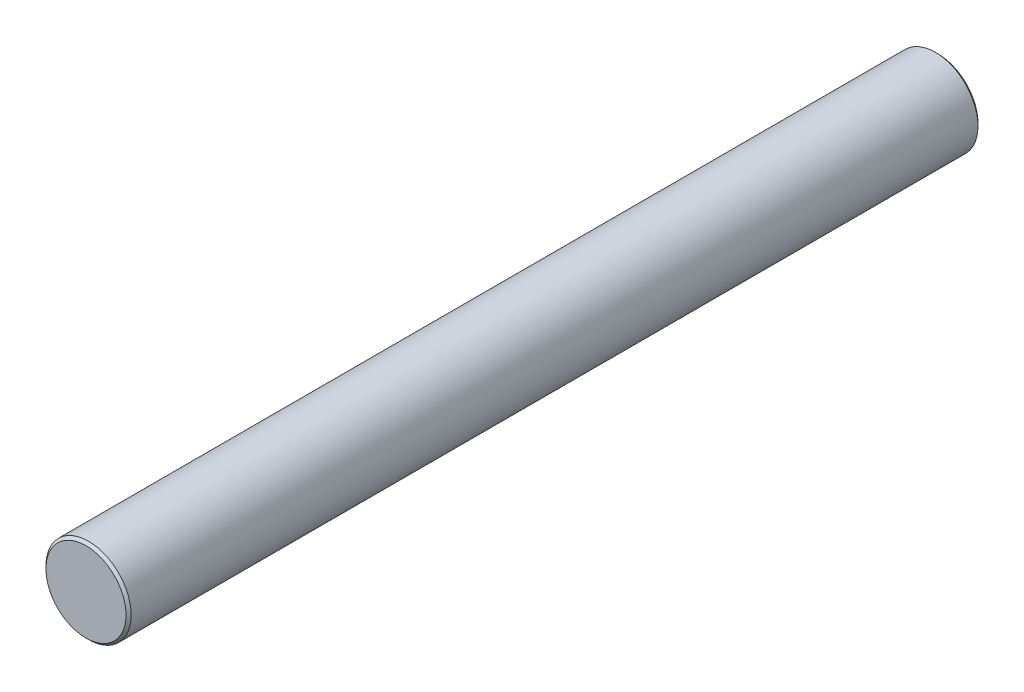
ISO-10303-21;
HEADER;
FILE_DESCRIPTION(('STEP AP214'),'2;1');
FILE_NAME('part.step','',(''),(''),'','','');
FILE_SCHEMA(('AUTOMOTIVE_DESIGN { 1 0 10303 214 1 1 1 1 }'));
ENDSEC;
DATA;
#1=APPLICATION_CONTEXT('core data for automotive mechanical design processes');
#2=APPLICATION_PROTOCOL_DEFINITION('international standard','automotive_design',2000,#1);
#3=PRODUCT_CONTEXT('',#1,'mechanical');
#4=PRODUCT('Part','Part','',(#3));
#5=PRODUCT_RELATED_PRODUCT_CATEGORY('part','',(#4));
#6=PRODUCT_DEFINITION_FORMATION('','',#4);
#7=PRODUCT_DEFINITION_CONTEXT('part definition',#1,'design');
#8=PRODUCT_DEFINITION('design','',#6,#7);
#9=PRODUCT_DEFINITION_SHAPE('','',#8);
#10=(LENGTH_UNIT() NAMED_UNIT(*) SI_UNIT(.MILLI.,.METRE.));
#11=(NAMED_UNIT(*) PLANE_ANGLE_UNIT() SI_UNIT($,.RADIAN.));
#12=(NAMED_UNIT(*) SI_UNIT($,.STERADIAN.) SOLID_ANGLE_UNIT());
#13=UNCERTAINTY_MEASURE_WITH_UNIT(LENGTH_MEASURE(1.E-05),#10,'distance_accuracy_value','');
#14=(GEOMETRIC_REPRESENTATION_CONTEXT(3) GLOBAL_UNCERTAINTY_ASSIGNED_CONTEXT((#13)) GLOBAL_UNIT_ASSIGNED_CONTEXT((#10,
#11,#12)) REPRESENTATION_CONTEXT('',''));
#15=CARTESIAN_POINT('',(0.,0.,0.));
#16=DIRECTION('',(0.,0.,1.));
#17=DIRECTION('',(1.,0.,0.));
#18=AXIS2_PLACEMENT_3D('',#15,#16,#17);
#19=CARTESIAN_POINT('',(0.,0.,50.));
#20=DIRECTION('',(0.,0.,-1.));
#21=DIRECTION('',(-1.,0.,0.));
#22=AXIS2_PLACEMENT_3D('',#19,#20,#21);
#23=CYLINDRICAL_SURFACE('',#22,5.);
#24=CARTESIAN_POINT('',(0.,0.,-49.7));
#25=DIRECTION('',(0.,0.,1.));
#26=DIRECTION('',(1.,0.,0.));
#27=AXIS2_PLACEMENT_3D('',#24,#25,#26);
#28=CIRCLE('',#27,5.);
#29=CARTESIAN_POINT('',(5.,0.,-49.7));
#30=VERTEX_POINT('',#29);
#31=EDGE_CURVE('E50',#30,#30,#28,.T.);
#32=ORIENTED_EDGE('',*,*,#31,.T.);
#33=EDGE_LOOP('',(#32));
#34=FACE_BOUND('',#33,.T.);
#35=CARTESIAN_POINT('',(0.,0.,49.7));
#36=DIRECTION('',(0.,0.,1.));
#37=DIRECTION('',(1.,0.,0.));
#38=AXIS2_PLACEMENT_3D('',#35,#36,#37);
#39=CIRCLE('',#38,5.);
#40=CARTESIAN_POINT('',(5.,0.,49.7));
#41=VERTEX_POINT('',#40);
#42=EDGE_CURVE('E55',#41,#41,#39,.F.);
#43=ORIENTED_EDGE('',*,*,#42,.T.);
#44=EDGE_LOOP('',(#43));
#45=FACE_BOUND('',#44,.T.);
#46=ADVANCED_FACE('F37',(#34,#45),#23,.T.);
#47=CARTESIAN_POINT('',(0.,0.,50.));
#48=DIRECTION('',(0.,0.,1.));
#49=DIRECTION('',(1.,0.,0.));
#50=AXIS2_PLACEMENT_3D('',#47,#48,#49);
#51=PLANE('',#50);
#52=CARTESIAN_POINT('',(0.,0.,50.));
#53=DIRECTION('',(0.,0.,1.));
#54=DIRECTION('',(1.,0.,0.));
#55=AXIS2_PLACEMENT_3D('',#52,#53,#54);
#56=CIRCLE('',#55,4.7);
#57=CARTESIAN_POINT('',(4.7,0.,50.));
#58=VERTEX_POINT('',#57);
#59=EDGE_CURVE('E10',#58,#58,#56,.T.);
#60=ORIENTED_EDGE('',*,*,#59,.T.);
#61=EDGE_LOOP('',(#60));
#62=FACE_BOUND('',#61,.T.);
#63=ADVANCED_FACE('F72',(#62),#51,.T.);
#64=CARTESIAN_POINT('',(0.,0.,-50.));
#65=DIRECTION('',(0.,0.,1.));
#66=DIRECTION('',(1.,0.,0.));
#67=AXIS2_PLACEMENT_3D('',#64,#65,#66);
#68=PLANE('',#67);
#69=CARTESIAN_POINT('',(0.,0.,-50.));
#70=DIRECTION('',(0.,0.,1.));
#71=DIRECTION('',(1.,0.,0.));
#72=AXIS2_PLACEMENT_3D('',#69,#70,#71);
#73=CIRCLE('',#72,4.69999999999998);
#74=CARTESIAN_POINT('',(4.69999999999998,0.,-50.));
#75=VERTEX_POINT('',#74);
#76=EDGE_CURVE('E45',#75,#75,#73,.F.);
#77=ORIENTED_EDGE('',*,*,#76,.T.);
#78=EDGE_LOOP('',(#77));
#79=FACE_BOUND('',#78,.T.);
#80=ADVANCED_FACE('F69',(#79),#68,.F.);
#81=CARTESIAN_POINT('',(0.,0.,-49.7));
#82=DIRECTION('',(0.,0.,1.));
#83=DIRECTION('',(1.,0.,0.));
#84=AXIS2_PLACEMENT_3D('',#81,#82,#83);
#85=CONICAL_SURFACE('',#84,5.,0.785398163397471);
#86=ORIENTED_EDGE('',*,*,#76,.F.);
#87=EDGE_LOOP('',(#86));
#88=FACE_BOUND('',#87,.T.);
#89=ORIENTED_EDGE('',*,*,#31,.F.);
#90=EDGE_LOOP('',(#89));
#91=FACE_BOUND('',#90,.T.);
#92=ADVANCED_FACE('F65',(#88,#91),#85,.T.);
#93=CARTESIAN_POINT('',(0.,0.,50.));
#94=DIRECTION('',(0.,0.,-1.));
#95=DIRECTION('',(-1.,0.,0.));
#96=AXIS2_PLACEMENT_3D('',#93,#94,#95);
#97=CONICAL_SURFACE('',#96,4.7,0.785398163397448);
#98=ORIENTED_EDGE('',*,*,#42,.F.);
#99=EDGE_LOOP('',(#98));
#100=FACE_BOUND('',#99,.T.);
#101=ORIENTED_EDGE('',*,*,#59,.F.);
#102=EDGE_LOOP('',(#101));
#103=FACE_BOUND('',#102,.T.);
#104=ADVANCED_FACE('F39',(#100,#103),#97,.T.);
#105=CLOSED_SHELL('',(#46,#63,#80,#92,#104));
#106=MANIFOLD_SOLID_BREP('B2',#105);
#107=ADVANCED_BREP_SHAPE_REPRESENTATION('',(#18,#106),#14);
#108=SHAPE_DEFINITION_REPRESENTATION(#9,#107);
ENDSEC;
END-ISO-10303-21;
